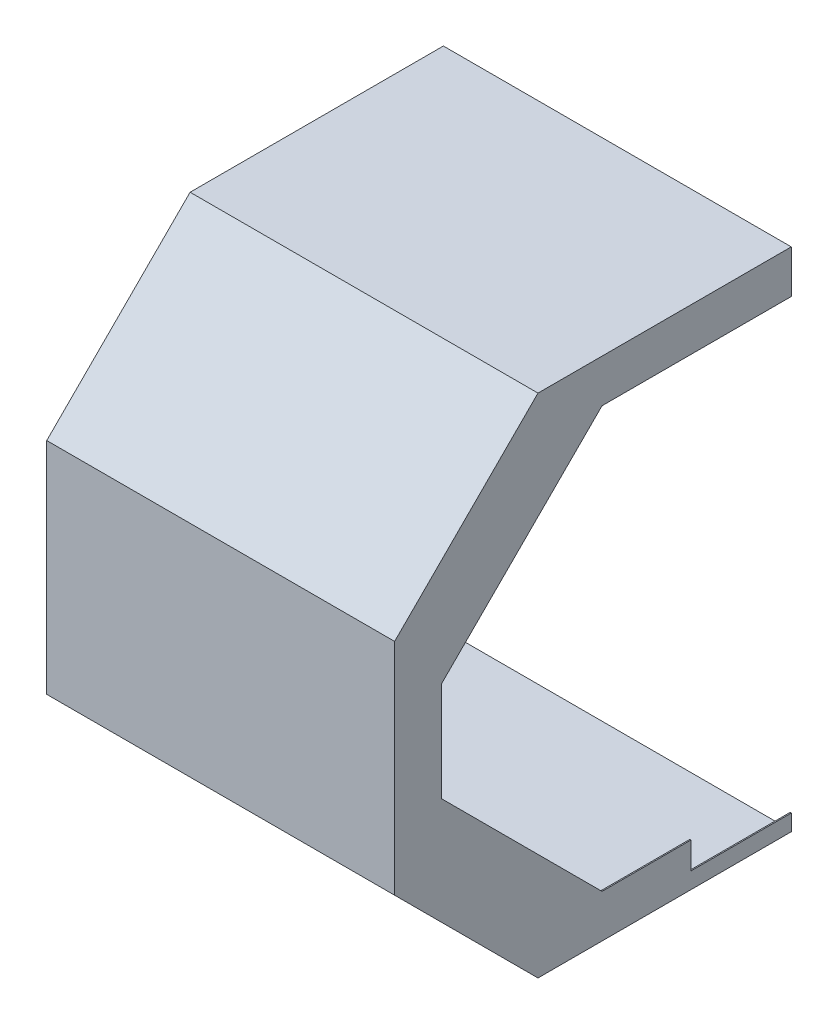
ISO-10303-21;
HEADER;
FILE_DESCRIPTION(('STEP AP214'),'2;1');
FILE_NAME('part.step','',(''),(''),'','','');
FILE_SCHEMA(('AUTOMOTIVE_DESIGN { 1 0 10303 214 1 1 1 1 }'));
ENDSEC;
DATA;
#1=APPLICATION_CONTEXT('core data for automotive mechanical design processes');
#2=APPLICATION_PROTOCOL_DEFINITION('international standard','automotive_design',2000,#1);
#3=PRODUCT_CONTEXT('',#1,'mechanical');
#4=PRODUCT('Part','Part','',(#3));
#5=PRODUCT_RELATED_PRODUCT_CATEGORY('part','',(#4));
#6=PRODUCT_DEFINITION_FORMATION('','',#4);
#7=PRODUCT_DEFINITION_CONTEXT('part definition',#1,'design');
#8=PRODUCT_DEFINITION('design','',#6,#7);
#9=PRODUCT_DEFINITION_SHAPE('','',#8);
#10=(LENGTH_UNIT() NAMED_UNIT(*) SI_UNIT(.MILLI.,.METRE.));
#11=(NAMED_UNIT(*) PLANE_ANGLE_UNIT() SI_UNIT($,.RADIAN.));
#12=(NAMED_UNIT(*) SI_UNIT($,.STERADIAN.) SOLID_ANGLE_UNIT());
#13=UNCERTAINTY_MEASURE_WITH_UNIT(LENGTH_MEASURE(1.E-05),#10,'distance_accuracy_value','');
#14=(GEOMETRIC_REPRESENTATION_CONTEXT(3) GLOBAL_UNCERTAINTY_ASSIGNED_CONTEXT((#13)) GLOBAL_UNIT_ASSIGNED_CONTEXT((#10,
#11,#12)) REPRESENTATION_CONTEXT('',''));
#15=CARTESIAN_POINT('',(0.,0.,0.));
#16=DIRECTION('',(0.,0.,1.));
#17=DIRECTION('',(1.,0.,0.));
#18=AXIS2_PLACEMENT_3D('',#15,#16,#17);
#19=CARTESIAN_POINT('',(-362.8,0.,0.));
#20=DIRECTION('',(-1.,0.,0.));
#21=DIRECTION('',(0.,-1.,0.));
#22=AXIS2_PLACEMENT_3D('',#19,#20,#21);
#23=PLANE('',#22);
#24=DIRECTION('',(0.,0.,1.));
#25=VECTOR('',#24,1.);
#26=CARTESIAN_POINT('',(-362.8,-263.8,-145.));
#27=LINE('',#26,#25);
#28=CARTESIAN_POINT('',(-362.8,-263.8,-145.));
#29=VERTEX_POINT('',#28);
#30=CARTESIAN_POINT('',(-362.8,-263.8,119.502943725152));
#31=VERTEX_POINT('',#30);
#32=EDGE_CURVE('E351',#29,#31,#27,.T.);
#33=ORIENTED_EDGE('',*,*,#32,.F.);
#34=DIRECTION('',(0.,-1.,0.));
#35=VECTOR('',#34,1.);
#36=CARTESIAN_POINT('',(-362.8,265.,-145.));
#37=LINE('',#36,#35);
#38=CARTESIAN_POINT('',(-362.8,263.8,-145.));
#39=VERTEX_POINT('',#38);
#40=EDGE_CURVE('E337',#39,#29,#37,.T.);
#41=ORIENTED_EDGE('',*,*,#40,.F.);
#42=DIRECTION('',(0.,0.,-1.));
#43=VECTOR('',#42,1.);
#44=CARTESIAN_POINT('',(-362.8,263.8,270.));
#45=LINE('',#44,#43);
#46=CARTESIAN_POINT('',(-362.8,263.8,119.502943725152));
#47=VERTEX_POINT('',#46);
#48=EDGE_CURVE('E334',#47,#39,#45,.T.);
#49=ORIENTED_EDGE('',*,*,#48,.F.);
#50=DIRECTION('',(0.,-0.707106781186548,0.707106781186548));
#51=VECTOR('',#50,1.);
#52=CARTESIAN_POINT('',(-362.8,191.651471862576,191.651471862576));
#53=LINE('',#52,#51);
#54=CARTESIAN_POINT('',(-362.8,114.502943725152,268.8));
#55=VERTEX_POINT('',#54);
#56=EDGE_CURVE('E342',#47,#55,#53,.T.);
#57=ORIENTED_EDGE('',*,*,#56,.T.);
#58=DIRECTION('',(0.,1.,0.));
#59=VECTOR('',#58,1.);
#60=CARTESIAN_POINT('',(-362.8,-265.,268.8));
#61=LINE('',#60,#59);
#62=CARTESIAN_POINT('',(-362.8,-114.502943725152,268.8));
#63=VERTEX_POINT('',#62);
#64=EDGE_CURVE('E354',#63,#55,#61,.T.);
#65=ORIENTED_EDGE('',*,*,#64,.F.);
#66=DIRECTION('',(0.,-0.707106781186548,-0.707106781186548));
#67=VECTOR('',#66,1.);
#68=CARTESIAN_POINT('',(-362.8,-191.651471862576,191.651471862576));
#69=LINE('',#68,#67);
#70=EDGE_CURVE('E348',#63,#31,#69,.T.);
#71=ORIENTED_EDGE('',*,*,#70,.T.);
#72=EDGE_LOOP('',(#33,#41,#49,#57,#65,#71));
#73=FACE_BOUND('',#72,.T.);
#74=DIRECTION('',(0.,0.,1.));
#75=VECTOR('',#74,1.);
#76=CARTESIAN_POINT('',(-362.8,-53.2,-139.5));
#77=LINE('',#76,#75);
#78=CARTESIAN_POINT('',(-362.8,-53.2,-139.5));
#79=VERTEX_POINT('',#78);
#80=CARTESIAN_POINT('',(-362.8,-53.2,-119.5));
#81=VERTEX_POINT('',#80);
#82=EDGE_CURVE('E33',#79,#81,#77,.T.);
#83=ORIENTED_EDGE('',*,*,#82,.T.);
#84=DIRECTION('',(0.,1.,0.));
#85=VECTOR('',#84,1.);
#86=CARTESIAN_POINT('',(-362.8,17.6289512568745,-119.5));
#87=LINE('',#86,#85);
#88=CARTESIAN_POINT('',(-362.8,16.798,-119.5));
#89=VERTEX_POINT('',#88);
#90=EDGE_CURVE('E224',#81,#89,#87,.T.);
#91=ORIENTED_EDGE('',*,*,#90,.T.);
#92=DIRECTION('',(0.,0.,-1.));
#93=VECTOR('',#92,1.);
#94=CARTESIAN_POINT('',(-362.8,16.798,-119.5));
#95=LINE('',#94,#93);
#96=CARTESIAN_POINT('',(-362.8,16.798,-139.5));
#97=VERTEX_POINT('',#96);
#98=EDGE_CURVE('E241',#89,#97,#95,.T.);
#99=ORIENTED_EDGE('',*,*,#98,.T.);
#100=DIRECTION('',(0.,-1.,0.));
#101=VECTOR('',#100,1.);
#102=CARTESIAN_POINT('',(-362.8,17.6289512568745,-139.5));
#103=LINE('',#102,#101);
#104=EDGE_CURVE('E38',#97,#79,#103,.T.);
#105=ORIENTED_EDGE('',*,*,#104,.T.);
#106=EDGE_LOOP('',(#83,#91,#99,#105));
#107=FACE_BOUND('',#106,.T.);
#108=ADVANCED_FACE('F18',(#73,#107),#23,.F.);
#109=CARTESIAN_POINT('',(0.,0.,0.));
#110=DIRECTION('',(-1.,0.,0.));
#111=DIRECTION('',(0.,-1.,0.));
#112=AXIS2_PLACEMENT_3D('',#109,#110,#111);
#113=PLANE('',#112);
#114=DIRECTION('',(0.,0.,1.));
#115=VECTOR('',#114,1.);
#116=CARTESIAN_POINT('',(0.,-248.,-145.));
#117=LINE('',#116,#115);
#118=CARTESIAN_POINT('',(0.,-248.,-145.));
#119=VERTEX_POINT('',#118);
#120=CARTESIAN_POINT('',(0.,-248.,-40.));
#121=VERTEX_POINT('',#120);
#122=EDGE_CURVE('E283',#119,#121,#117,.T.);
#123=ORIENTED_EDGE('',*,*,#122,.T.);
#124=DIRECTION('',(0.,1.,0.));
#125=VECTOR('',#124,1.);
#126=CARTESIAN_POINT('',(0.,-248.,-40.));
#127=LINE('',#126,#125);
#128=CARTESIAN_POINT('',(0.,-220.,-40.));
#129=VERTEX_POINT('',#128);
#130=EDGE_CURVE('E287',#121,#129,#127,.T.);
#131=ORIENTED_EDGE('',*,*,#130,.T.);
#132=DIRECTION('',(0.,0.,1.));
#133=VECTOR('',#132,1.);
#134=CARTESIAN_POINT('',(0.,-220.,-145.));
#135=LINE('',#134,#133);
#136=CARTESIAN_POINT('',(0.,-220.,53.));
#137=VERTEX_POINT('',#136);
#138=EDGE_CURVE('E303',#129,#137,#135,.T.);
#139=ORIENTED_EDGE('',*,*,#138,.T.);
#140=DIRECTION('',(0.,0.707106781186547,0.707106781186548));
#141=VECTOR('',#140,1.);
#142=CARTESIAN_POINT('',(0.,-220.,53.));
#143=LINE('',#142,#141);
#144=CARTESIAN_POINT('',(0.,-52.,221.));
#145=VERTEX_POINT('',#144);
#146=EDGE_CURVE('E306',#137,#145,#143,.T.);
#147=ORIENTED_EDGE('',*,*,#146,.T.);
#148=DIRECTION('',(0.,1.,0.));
#149=VECTOR('',#148,1.);
#150=CARTESIAN_POINT('',(0.,-52.,221.));
#151=LINE('',#150,#149);
#152=CARTESIAN_POINT('',(0.,52.,221.));
#153=VERTEX_POINT('',#152);
#154=EDGE_CURVE('E310',#145,#153,#151,.T.);
#155=ORIENTED_EDGE('',*,*,#154,.T.);
#156=DIRECTION('',(0.,0.707106781186548,-0.707106781186547));
#157=VECTOR('',#156,1.);
#158=CARTESIAN_POINT('',(0.,52.,221.));
#159=LINE('',#158,#157);
#160=CARTESIAN_POINT('',(0.,220.,53.));
#161=VERTEX_POINT('',#160);
#162=EDGE_CURVE('E314',#153,#161,#159,.T.);
#163=ORIENTED_EDGE('',*,*,#162,.T.);
#164=DIRECTION('',(0.,0.,-1.));
#165=VECTOR('',#164,1.);
#166=CARTESIAN_POINT('',(0.,220.,53.));
#167=LINE('',#166,#165);
#168=CARTESIAN_POINT('',(0.,220.,-145.));
#169=VERTEX_POINT('',#168);
#170=EDGE_CURVE('E318',#161,#169,#167,.T.);
#171=ORIENTED_EDGE('',*,*,#170,.T.);
#172=DIRECTION('',(0.,-1.,0.));
#173=VECTOR('',#172,1.);
#174=CARTESIAN_POINT('',(0.,265.,-145.));
#175=LINE('',#174,#173);
#176=CARTESIAN_POINT('',(0.,265.,-145.));
#177=VERTEX_POINT('',#176);
#178=EDGE_CURVE('E419',#177,#169,#175,.T.);
#179=ORIENTED_EDGE('',*,*,#178,.F.);
#180=DIRECTION('',(0.,0.,-1.));
#181=VECTOR('',#180,1.);
#182=CARTESIAN_POINT('',(0.,265.,270.));
#183=LINE('',#182,#181);
#184=CARTESIAN_POINT('',(0.,265.,120.));
#185=VERTEX_POINT('',#184);
#186=EDGE_CURVE('E406',#185,#177,#183,.T.);
#187=ORIENTED_EDGE('',*,*,#186,.F.);
#188=DIRECTION('',(0.,0.707106781186548,-0.707106781186548));
#189=VECTOR('',#188,1.);
#190=CARTESIAN_POINT('',(0.,115.,270.));
#191=LINE('',#190,#189);
#192=CARTESIAN_POINT('',(0.,115.,270.));
#193=VERTEX_POINT('',#192);
#194=EDGE_CURVE('E380',#193,#185,#191,.T.);
#195=ORIENTED_EDGE('',*,*,#194,.F.);
#196=DIRECTION('',(0.,1.,0.));
#197=VECTOR('',#196,1.);
#198=CARTESIAN_POINT('',(0.,-265.,270.));
#199=LINE('',#198,#197);
#200=CARTESIAN_POINT('',(0.,-115.,270.));
#201=VERTEX_POINT('',#200);
#202=EDGE_CURVE('E418',#201,#193,#199,.T.);
#203=ORIENTED_EDGE('',*,*,#202,.F.);
#204=DIRECTION('',(0.,0.707106781186548,0.707106781186548));
#205=VECTOR('',#204,1.);
#206=CARTESIAN_POINT('',(0.,-265.,120.));
#207=LINE('',#206,#205);
#208=CARTESIAN_POINT('',(0.,-265.,120.));
#209=VERTEX_POINT('',#208);
#210=EDGE_CURVE('E396',#209,#201,#207,.T.);
#211=ORIENTED_EDGE('',*,*,#210,.F.);
#212=DIRECTION('',(0.,0.,1.));
#213=VECTOR('',#212,1.);
#214=CARTESIAN_POINT('',(0.,-265.,-145.));
#215=LINE('',#214,#213);
#216=CARTESIAN_POINT('',(0.,-265.,-145.));
#217=VERTEX_POINT('',#216);
#218=EDGE_CURVE('E423',#217,#209,#215,.T.);
#219=ORIENTED_EDGE('',*,*,#218,.F.);
#220=EDGE_CURVE('E424',#119,#217,#175,.T.);
#221=ORIENTED_EDGE('',*,*,#220,.F.);
#222=EDGE_LOOP('',(#123,#131,#139,#147,#155,#163,#171,#179,#187,#195,#203,#211,#219,#221));
#223=FACE_BOUND('',#222,.T.);
#224=ADVANCED_FACE('F462',(#223),#113,.F.);
#225=CARTESIAN_POINT('',(-1.2,0.,0.));
#226=DIRECTION('',(-1.,0.,0.));
#227=DIRECTION('',(0.,-1.,0.));
#228=AXIS2_PLACEMENT_3D('',#225,#226,#227);
#229=PLANE('',#228);
#230=DIRECTION('',(0.,-1.,0.));
#231=VECTOR('',#230,1.);
#232=CARTESIAN_POINT('',(-1.2,0.,-40.));
#233=LINE('',#232,#231);
#234=CARTESIAN_POINT('',(-1.19999999999998,-220.,-40.));
#235=VERTEX_POINT('',#234);
#236=CARTESIAN_POINT('',(-1.19999999999998,-248.,-40.));
#237=VERTEX_POINT('',#236);
#238=EDGE_CURVE('E297',#235,#237,#233,.T.);
#239=ORIENTED_EDGE('',*,*,#238,.T.);
#240=DIRECTION('',(0.,0.,-1.));
#241=VECTOR('',#240,1.);
#242=CARTESIAN_POINT('',(-1.20000000000001,-248.,0.));
#243=LINE('',#242,#241);
#244=CARTESIAN_POINT('',(-1.19999999999998,-248.,-145.));
#245=VERTEX_POINT('',#244);
#246=EDGE_CURVE('E300',#237,#245,#243,.T.);
#247=ORIENTED_EDGE('',*,*,#246,.T.);
#248=DIRECTION('',(0.,-1.,0.));
#249=VECTOR('',#248,1.);
#250=CARTESIAN_POINT('',(-1.19999999999998,265.,-145.));
#251=LINE('',#250,#249);
#252=CARTESIAN_POINT('',(-1.20000000000002,-263.8,-145.));
#253=VERTEX_POINT('',#252);
#254=EDGE_CURVE('E347',#245,#253,#251,.T.);
#255=ORIENTED_EDGE('',*,*,#254,.T.);
#256=DIRECTION('',(0.,0.,1.));
#257=VECTOR('',#256,1.);
#258=CARTESIAN_POINT('',(-1.19999999999998,-263.8,-145.));
#259=LINE('',#258,#257);
#260=CARTESIAN_POINT('',(-1.20000000000002,-263.8,119.502943725152));
#261=VERTEX_POINT('',#260);
#262=EDGE_CURVE('E360',#253,#261,#259,.T.);
#263=ORIENTED_EDGE('',*,*,#262,.T.);
#264=DIRECTION('',(0.,0.707106781186548,0.707106781186548));
#265=VECTOR('',#264,1.);
#266=CARTESIAN_POINT('',(-1.19999999999998,-264.151471862576,119.151471862576));
#267=LINE('',#266,#265);
#268=CARTESIAN_POINT('',(-1.2,-114.502943725152,268.8));
#269=VERTEX_POINT('',#268);
#270=EDGE_CURVE('E350',#261,#269,#267,.T.);
#271=ORIENTED_EDGE('',*,*,#270,.T.);
#272=DIRECTION('',(0.,1.,0.));
#273=VECTOR('',#272,1.);
#274=CARTESIAN_POINT('',(-1.19999999999998,-265.,268.8));
#275=LINE('',#274,#273);
#276=CARTESIAN_POINT('',(-1.2,114.502943725152,268.8));
#277=VERTEX_POINT('',#276);
#278=EDGE_CURVE('E338',#269,#277,#275,.T.);
#279=ORIENTED_EDGE('',*,*,#278,.T.);
#280=DIRECTION('',(0.,0.707106781186548,-0.707106781186548));
#281=VECTOR('',#280,1.);
#282=CARTESIAN_POINT('',(-1.19999999999998,114.151471862576,269.151471862576));
#283=LINE('',#282,#281);
#284=CARTESIAN_POINT('',(-1.19999999999998,263.8,119.502943725152));
#285=VERTEX_POINT('',#284);
#286=EDGE_CURVE('E333',#277,#285,#283,.T.);
#287=ORIENTED_EDGE('',*,*,#286,.T.);
#288=DIRECTION('',(0.,0.,-1.));
#289=VECTOR('',#288,1.);
#290=CARTESIAN_POINT('',(-1.19999999999998,263.8,270.));
#291=LINE('',#290,#289);
#292=CARTESIAN_POINT('',(-1.19999999999998,263.8,-145.));
#293=VERTEX_POINT('',#292);
#294=EDGE_CURVE('E344',#285,#293,#291,.T.);
#295=ORIENTED_EDGE('',*,*,#294,.T.);
#296=CARTESIAN_POINT('',(-1.19999999999998,220.,-145.));
#297=VERTEX_POINT('',#296);
#298=EDGE_CURVE('E364',#293,#297,#251,.T.);
#299=ORIENTED_EDGE('',*,*,#298,.T.);
#300=DIRECTION('',(0.,0.,1.));
#301=VECTOR('',#300,1.);
#302=CARTESIAN_POINT('',(-1.19999999999999,220.,0.));
#303=LINE('',#302,#301);
#304=CARTESIAN_POINT('',(-1.19999999999998,220.,53.));
#305=VERTEX_POINT('',#304);
#306=EDGE_CURVE('E438',#297,#305,#303,.T.);
#307=ORIENTED_EDGE('',*,*,#306,.T.);
#308=DIRECTION('',(0.,-0.707106781186548,0.707106781186547));
#309=VECTOR('',#308,1.);
#310=CARTESIAN_POINT('',(-1.2,136.5,136.5));
#311=LINE('',#310,#309);
#312=CARTESIAN_POINT('',(-1.19999999999998,52.,221.));
#313=VERTEX_POINT('',#312);
#314=EDGE_CURVE('E441',#305,#313,#311,.T.);
#315=ORIENTED_EDGE('',*,*,#314,.T.);
#316=DIRECTION('',(0.,-1.,0.));
#317=VECTOR('',#316,1.);
#318=CARTESIAN_POINT('',(-1.2,0.,221.));
#319=LINE('',#318,#317);
#320=CARTESIAN_POINT('',(-1.19999999999998,-52.,221.));
#321=VERTEX_POINT('',#320);
#322=EDGE_CURVE('E444',#313,#321,#319,.T.);
#323=ORIENTED_EDGE('',*,*,#322,.T.);
#324=DIRECTION('',(0.,-0.707106781186548,-0.707106781186548));
#325=VECTOR('',#324,1.);
#326=CARTESIAN_POINT('',(-1.2,-136.5,136.5));
#327=LINE('',#326,#325);
#328=CARTESIAN_POINT('',(-1.19999999999998,-220.,53.));
#329=VERTEX_POINT('',#328);
#330=EDGE_CURVE('E447',#321,#329,#327,.T.);
#331=ORIENTED_EDGE('',*,*,#330,.T.);
#332=DIRECTION('',(0.,0.,-1.));
#333=VECTOR('',#332,1.);
#334=CARTESIAN_POINT('',(-1.20000000000001,-220.,0.));
#335=LINE('',#334,#333);
#336=EDGE_CURVE('E26',#329,#235,#335,.T.);
#337=ORIENTED_EDGE('',*,*,#336,.T.);
#338=EDGE_LOOP('',(#239,#247,#255,#263,#271,#279,#287,#295,#299,#307,#315,#323,#331,#337));
#339=FACE_BOUND('',#338,.T.);
#340=ADVANCED_FACE('F451',(#339),#229,.T.);
#341=CARTESIAN_POINT('',(-765.258779760154,-220.,-145.));
#342=DIRECTION('',(0.,1.,0.));
#343=DIRECTION('',(0.,0.,1.));
#344=AXIS2_PLACEMENT_3D('',#341,#342,#343);
#345=PLANE('',#344);
#346=ORIENTED_EDGE('',*,*,#138,.F.);
#347=DIRECTION('',(-1.,0.,0.));
#348=VECTOR('',#347,1.);
#349=CARTESIAN_POINT('',(-765.258779760154,-220.,-40.));
#350=LINE('',#349,#348);
#351=EDGE_CURVE('E11',#129,#235,#350,.T.);
#352=ORIENTED_EDGE('',*,*,#351,.T.);
#353=ORIENTED_EDGE('',*,*,#336,.F.);
#354=DIRECTION('',(1.,0.,0.));
#355=VECTOR('',#354,1.);
#356=CARTESIAN_POINT('',(-765.258779760154,-220.,53.));
#357=LINE('',#356,#355);
#358=EDGE_CURVE('E330',#329,#137,#357,.T.);
#359=ORIENTED_EDGE('',*,*,#358,.T.);
#360=EDGE_LOOP('',(#346,#352,#353,#359));
#361=FACE_BOUND('',#360,.T.);
#362=ADVANCED_FACE('F455',(#361),#345,.T.);
#363=CARTESIAN_POINT('',(-364.,265.,-145.));
#364=DIRECTION('',(0.,0.,1.));
#365=DIRECTION('',(0.,-1.,0.));
#366=AXIS2_PLACEMENT_3D('',#363,#364,#365);
#367=PLANE('',#366);
#368=DIRECTION('',(1.,0.,0.));
#369=VECTOR('',#368,1.);
#370=CARTESIAN_POINT('',(-364.,-265.,-145.));
#371=LINE('',#370,#369);
#372=CARTESIAN_POINT('',(-364.,-265.,-145.));
#373=VERTEX_POINT('',#372);
#374=EDGE_CURVE('E416',#373,#217,#371,.T.);
#375=ORIENTED_EDGE('',*,*,#374,.F.);
#376=DIRECTION('',(0.,-1.,0.));
#377=VECTOR('',#376,1.);
#378=CARTESIAN_POINT('',(-364.,265.,-145.));
#379=LINE('',#378,#377);
#380=CARTESIAN_POINT('',(-364.,265.,-145.));
#381=VERTEX_POINT('',#380);
#382=EDGE_CURVE('E407',#381,#373,#379,.T.);
#383=ORIENTED_EDGE('',*,*,#382,.F.);
#384=DIRECTION('',(1.,0.,0.));
#385=VECTOR('',#384,1.);
#386=CARTESIAN_POINT('',(-364.,265.,-145.));
#387=LINE('',#386,#385);
#388=EDGE_CURVE('E435',#381,#177,#387,.T.);
#389=ORIENTED_EDGE('',*,*,#388,.T.);
#390=ORIENTED_EDGE('',*,*,#178,.T.);
#391=DIRECTION('',(1.,0.,0.));
#392=VECTOR('',#391,1.);
#393=CARTESIAN_POINT('',(-765.258779760154,220.,-145.));
#394=LINE('',#393,#392);
#395=EDGE_CURVE('E322',#297,#169,#394,.T.);
#396=ORIENTED_EDGE('',*,*,#395,.F.);
#397=ORIENTED_EDGE('',*,*,#298,.F.);
#398=DIRECTION('',(1.,0.,0.));
#399=VECTOR('',#398,1.);
#400=CARTESIAN_POINT('',(-364.,263.8,-145.));
#401=LINE('',#400,#399);
#402=EDGE_CURVE('E377',#39,#293,#401,.T.);
#403=ORIENTED_EDGE('',*,*,#402,.F.);
#404=ORIENTED_EDGE('',*,*,#40,.T.);
#405=DIRECTION('',(1.,0.,0.));
#406=VECTOR('',#405,1.);
#407=CARTESIAN_POINT('',(-364.,-263.8,-145.));
#408=LINE('',#407,#406);
#409=EDGE_CURVE('E359',#29,#253,#408,.T.);
#410=ORIENTED_EDGE('',*,*,#409,.T.);
#411=ORIENTED_EDGE('',*,*,#254,.F.);
#412=DIRECTION('',(1.,0.,0.));
#413=VECTOR('',#412,1.);
#414=CARTESIAN_POINT('',(-765.258779760154,-248.,-145.));
#415=LINE('',#414,#413);
#416=EDGE_CURVE('E294',#245,#119,#415,.T.);
#417=ORIENTED_EDGE('',*,*,#416,.T.);
#418=ORIENTED_EDGE('',*,*,#220,.T.);
#419=EDGE_LOOP('',(#375,#383,#389,#390,#396,#397,#403,#404,#410,#411,#417,#418));
#420=FACE_BOUND('',#419,.T.);
#421=ADVANCED_FACE('F473',(#420),#367,.F.);
#422=CARTESIAN_POINT('',(-364.,265.,270.));
#423=DIRECTION('',(0.,-1.,0.));
#424=DIRECTION('',(0.,0.,-1.));
#425=AXIS2_PLACEMENT_3D('',#422,#423,#424);
#426=PLANE('',#425);
#427=DIRECTION('',(0.,0.,-1.));
#428=VECTOR('',#427,1.);
#429=CARTESIAN_POINT('',(-364.,265.,270.));
#430=LINE('',#429,#428);
#431=CARTESIAN_POINT('',(-364.,265.,120.));
#432=VERTEX_POINT('',#431);
#433=EDGE_CURVE('E410',#432,#381,#430,.T.);
#434=ORIENTED_EDGE('',*,*,#433,.F.);
#435=DIRECTION('',(1.,0.,0.));
#436=VECTOR('',#435,1.);
#437=CARTESIAN_POINT('',(-765.258779760154,265.,120.));
#438=LINE('',#437,#436);
#439=EDGE_CURVE('E391',#432,#185,#438,.T.);
#440=ORIENTED_EDGE('',*,*,#439,.T.);
#441=ORIENTED_EDGE('',*,*,#186,.T.);
#442=ORIENTED_EDGE('',*,*,#388,.F.);
#443=EDGE_LOOP('',(#434,#440,#441,#442));
#444=FACE_BOUND('',#443,.T.);
#445=ADVANCED_FACE('F20',(#444),#426,.F.);
#446=CARTESIAN_POINT('',(-364.,-265.,-145.));
#447=DIRECTION('',(0.,1.,0.));
#448=DIRECTION('',(0.,0.,1.));
#449=AXIS2_PLACEMENT_3D('',#446,#447,#448);
#450=PLANE('',#449);
#451=ORIENTED_EDGE('',*,*,#218,.T.);
#452=DIRECTION('',(1.,0.,0.));
#453=VECTOR('',#452,1.);
#454=CARTESIAN_POINT('',(-765.258779760154,-265.,120.));
#455=LINE('',#454,#453);
#456=CARTESIAN_POINT('',(-364.,-265.,120.));
#457=VERTEX_POINT('',#456);
#458=EDGE_CURVE('E402',#457,#209,#455,.T.);
#459=ORIENTED_EDGE('',*,*,#458,.F.);
#460=DIRECTION('',(0.,0.,1.));
#461=VECTOR('',#460,1.);
#462=CARTESIAN_POINT('',(-364.,-265.,-145.));
#463=LINE('',#462,#461);
#464=EDGE_CURVE('E409',#373,#457,#463,.T.);
#465=ORIENTED_EDGE('',*,*,#464,.F.);
#466=ORIENTED_EDGE('',*,*,#374,.T.);
#467=EDGE_LOOP('',(#451,#459,#465,#466));
#468=FACE_BOUND('',#467,.T.);
#469=ADVANCED_FACE('F607',(#468),#450,.F.);
#470=CARTESIAN_POINT('',(-364.,-265.,270.));
#471=DIRECTION('',(0.,0.,-1.));
#472=DIRECTION('',(0.,1.,0.));
#473=AXIS2_PLACEMENT_3D('',#470,#471,#472);
#474=PLANE('',#473);
#475=ORIENTED_EDGE('',*,*,#202,.T.);
#476=DIRECTION('',(1.,0.,0.));
#477=VECTOR('',#476,1.);
#478=CARTESIAN_POINT('',(-765.258779760154,115.,270.));
#479=LINE('',#478,#477);
#480=CARTESIAN_POINT('',(-364.,115.,270.));
#481=VERTEX_POINT('',#480);
#482=EDGE_CURVE('E389',#481,#193,#479,.T.);
#483=ORIENTED_EDGE('',*,*,#482,.F.);
#484=DIRECTION('',(0.,1.,0.));
#485=VECTOR('',#484,1.);
#486=CARTESIAN_POINT('',(-364.,-265.,270.));
#487=LINE('',#486,#485);
#488=CARTESIAN_POINT('',(-364.,-115.,270.));
#489=VERTEX_POINT('',#488);
#490=EDGE_CURVE('E413',#489,#481,#487,.T.);
#491=ORIENTED_EDGE('',*,*,#490,.F.);
#492=DIRECTION('',(1.,0.,0.));
#493=VECTOR('',#492,1.);
#494=CARTESIAN_POINT('',(-765.258779760154,-115.,270.));
#495=LINE('',#494,#493);
#496=EDGE_CURVE('E399',#489,#201,#495,.T.);
#497=ORIENTED_EDGE('',*,*,#496,.T.);
#498=EDGE_LOOP('',(#475,#483,#491,#497));
#499=FACE_BOUND('',#498,.T.);
#500=ADVANCED_FACE('F602',(#499),#474,.F.);
#501=CARTESIAN_POINT('',(-364.,0.,0.));
#502=DIRECTION('',(-1.,0.,0.));
#503=DIRECTION('',(0.,-1.,0.));
#504=AXIS2_PLACEMENT_3D('',#501,#502,#503);
#505=PLANE('',#504);
#506=ORIENTED_EDGE('',*,*,#382,.T.);
#507=ORIENTED_EDGE('',*,*,#464,.T.);
#508=DIRECTION('',(0.,-0.707106781186548,-0.707106781186548));
#509=VECTOR('',#508,1.);
#510=CARTESIAN_POINT('',(-364.,-192.5,192.5));
#511=LINE('',#510,#509);
#512=EDGE_CURVE('E404',#489,#457,#511,.T.);
#513=ORIENTED_EDGE('',*,*,#512,.F.);
#514=ORIENTED_EDGE('',*,*,#490,.T.);
#515=DIRECTION('',(0.,-0.707106781186548,0.707106781186548));
#516=VECTOR('',#515,1.);
#517=CARTESIAN_POINT('',(-364.,192.5,192.5));
#518=LINE('',#517,#516);
#519=EDGE_CURVE('E394',#432,#481,#518,.T.);
#520=ORIENTED_EDGE('',*,*,#519,.F.);
#521=ORIENTED_EDGE('',*,*,#433,.T.);
#522=EDGE_LOOP('',(#506,#507,#513,#514,#520,#521));
#523=FACE_BOUND('',#522,.T.);
#524=ADVANCED_FACE('F599',(#523),#505,.T.);
#525=CARTESIAN_POINT('',(-765.258779760154,-265.,120.));
#526=DIRECTION('',(0.,0.707106781186548,-0.707106781186548));
#527=DIRECTION('',(0.,0.707106781186548,0.707106781186548));
#528=AXIS2_PLACEMENT_3D('',#525,#526,#527);
#529=PLANE('',#528);
#530=ORIENTED_EDGE('',*,*,#512,.T.);
#531=ORIENTED_EDGE('',*,*,#458,.T.);
#532=ORIENTED_EDGE('',*,*,#210,.T.);
#533=ORIENTED_EDGE('',*,*,#496,.F.);
#534=EDGE_LOOP('',(#530,#531,#532,#533));
#535=FACE_BOUND('',#534,.T.);
#536=ADVANCED_FACE('F595',(#535),#529,.F.);
#537=CARTESIAN_POINT('',(-765.258779760154,115.,270.));
#538=DIRECTION('',(0.,-0.707106781186548,-0.707106781186548));
#539=DIRECTION('',(0.,0.707106781186548,-0.707106781186548));
#540=AXIS2_PLACEMENT_3D('',#537,#538,#539);
#541=PLANE('',#540);
#542=ORIENTED_EDGE('',*,*,#519,.T.);
#543=ORIENTED_EDGE('',*,*,#482,.T.);
#544=ORIENTED_EDGE('',*,*,#194,.T.);
#545=ORIENTED_EDGE('',*,*,#439,.F.);
#546=EDGE_LOOP('',(#542,#543,#544,#545));
#547=FACE_BOUND('',#546,.T.);
#548=ADVANCED_FACE('F591',(#547),#541,.F.);
#549=CARTESIAN_POINT('',(-364.,263.8,270.));
#550=DIRECTION('',(0.,-1.,0.));
#551=DIRECTION('',(0.,0.,-1.));
#552=AXIS2_PLACEMENT_3D('',#549,#550,#551);
#553=PLANE('',#552);
#554=ORIENTED_EDGE('',*,*,#48,.T.);
#555=ORIENTED_EDGE('',*,*,#402,.T.);
#556=ORIENTED_EDGE('',*,*,#294,.F.);
#557=DIRECTION('',(1.,0.,0.));
#558=VECTOR('',#557,1.);
#559=CARTESIAN_POINT('',(-364.,263.8,119.502943725152));
#560=LINE('',#559,#558);
#561=EDGE_CURVE('E339',#47,#285,#560,.T.);
#562=ORIENTED_EDGE('',*,*,#561,.F.);
#563=EDGE_LOOP('',(#554,#555,#556,#562));
#564=FACE_BOUND('',#563,.T.);
#565=ADVANCED_FACE('F594',(#564),#553,.T.);
#566=CARTESIAN_POINT('',(-364.,-263.8,-145.));
#567=DIRECTION('',(0.,1.,0.));
#568=DIRECTION('',(0.,0.,1.));
#569=AXIS2_PLACEMENT_3D('',#566,#567,#568);
#570=PLANE('',#569);
#571=ORIENTED_EDGE('',*,*,#262,.F.);
#572=ORIENTED_EDGE('',*,*,#409,.F.);
#573=ORIENTED_EDGE('',*,*,#32,.T.);
#574=DIRECTION('',(1.,0.,0.));
#575=VECTOR('',#574,1.);
#576=CARTESIAN_POINT('',(-765.258779760154,-263.8,119.502943725152));
#577=LINE('',#576,#575);
#578=EDGE_CURVE('E356',#31,#261,#577,.T.);
#579=ORIENTED_EDGE('',*,*,#578,.T.);
#580=EDGE_LOOP('',(#571,#572,#573,#579));
#581=FACE_BOUND('',#580,.T.);
#582=ADVANCED_FACE('F624',(#581),#570,.T.);
#583=CARTESIAN_POINT('',(-364.,-265.,268.8));
#584=DIRECTION('',(0.,0.,-1.));
#585=DIRECTION('',(0.,1.,0.));
#586=AXIS2_PLACEMENT_3D('',#583,#584,#585);
#587=PLANE('',#586);
#588=ORIENTED_EDGE('',*,*,#278,.F.);
#589=DIRECTION('',(1.,0.,0.));
#590=VECTOR('',#589,1.);
#591=CARTESIAN_POINT('',(-364.,-114.502943725152,268.8));
#592=LINE('',#591,#590);
#593=EDGE_CURVE('E366',#63,#269,#592,.T.);
#594=ORIENTED_EDGE('',*,*,#593,.F.);
#595=ORIENTED_EDGE('',*,*,#64,.T.);
#596=DIRECTION('',(1.,0.,0.));
#597=VECTOR('',#596,1.);
#598=CARTESIAN_POINT('',(-765.258779760154,114.502943725152,268.8));
#599=LINE('',#598,#597);
#600=EDGE_CURVE('E343',#55,#277,#599,.T.);
#601=ORIENTED_EDGE('',*,*,#600,.T.);
#602=EDGE_LOOP('',(#588,#594,#595,#601));
#603=FACE_BOUND('',#602,.T.);
#604=ADVANCED_FACE('F579',(#603),#587,.T.);
#605=CARTESIAN_POINT('',(-765.258779760154,-264.151471862576,119.151471862576));
#606=DIRECTION('',(0.,0.707106781186548,-0.707106781186548));
#607=DIRECTION('',(0.,0.707106781186548,0.707106781186548));
#608=AXIS2_PLACEMENT_3D('',#605,#606,#607);
#609=PLANE('',#608);
#610=ORIENTED_EDGE('',*,*,#70,.F.);
#611=ORIENTED_EDGE('',*,*,#593,.T.);
#612=ORIENTED_EDGE('',*,*,#270,.F.);
#613=ORIENTED_EDGE('',*,*,#578,.F.);
#614=EDGE_LOOP('',(#610,#611,#612,#613));
#615=FACE_BOUND('',#614,.T.);
#616=ADVANCED_FACE('F583',(#615),#609,.T.);
#617=CARTESIAN_POINT('',(-765.258779760154,114.151471862576,269.151471862576));
#618=DIRECTION('',(0.,-0.707106781186548,-0.707106781186548));
#619=DIRECTION('',(0.,0.707106781186548,-0.707106781186548));
#620=AXIS2_PLACEMENT_3D('',#617,#618,#619);
#621=PLANE('',#620);
#622=ORIENTED_EDGE('',*,*,#56,.F.);
#623=ORIENTED_EDGE('',*,*,#561,.T.);
#624=ORIENTED_EDGE('',*,*,#286,.F.);
#625=ORIENTED_EDGE('',*,*,#600,.F.);
#626=EDGE_LOOP('',(#622,#623,#624,#625));
#627=FACE_BOUND('',#626,.T.);
#628=ADVANCED_FACE('F586',(#627),#621,.T.);
#629=CARTESIAN_POINT('',(-765.258779760154,-220.,53.));
#630=DIRECTION('',(0.,0.707106781186548,-0.707106781186547));
#631=DIRECTION('',(0.,0.707106781186548,0.707106781186548));
#632=AXIS2_PLACEMENT_3D('',#629,#630,#631);
#633=PLANE('',#632);
#634=DIRECTION('',(1.,0.,0.));
#635=VECTOR('',#634,1.);
#636=CARTESIAN_POINT('',(-765.258779760154,-52.,221.));
#637=LINE('',#636,#635);
#638=EDGE_CURVE('E328',#321,#145,#637,.T.);
#639=ORIENTED_EDGE('',*,*,#638,.T.);
#640=ORIENTED_EDGE('',*,*,#146,.F.);
#641=ORIENTED_EDGE('',*,*,#358,.F.);
#642=ORIENTED_EDGE('',*,*,#330,.F.);
#643=EDGE_LOOP('',(#639,#640,#641,#642));
#644=FACE_BOUND('',#643,.T.);
#645=ADVANCED_FACE('F458',(#644),#633,.T.);
#646=CARTESIAN_POINT('',(-765.258779760154,-52.,221.));
#647=DIRECTION('',(0.,0.,-1.));
#648=DIRECTION('',(-1.,0.,0.));
#649=AXIS2_PLACEMENT_3D('',#646,#647,#648);
#650=PLANE('',#649);
#651=DIRECTION('',(1.,0.,0.));
#652=VECTOR('',#651,1.);
#653=CARTESIAN_POINT('',(-765.258779760154,52.,221.));
#654=LINE('',#653,#652);
#655=EDGE_CURVE('E326',#313,#153,#654,.T.);
#656=ORIENTED_EDGE('',*,*,#655,.T.);
#657=ORIENTED_EDGE('',*,*,#154,.F.);
#658=ORIENTED_EDGE('',*,*,#638,.F.);
#659=ORIENTED_EDGE('',*,*,#322,.F.);
#660=EDGE_LOOP('',(#656,#657,#658,#659));
#661=FACE_BOUND('',#660,.T.);
#662=ADVANCED_FACE('F656',(#661),#650,.T.);
#663=CARTESIAN_POINT('',(-765.258779760154,52.,221.));
#664=DIRECTION('',(0.,-0.707106781186547,-0.707106781186548));
#665=DIRECTION('',(0.,0.707106781186548,-0.707106781186547));
#666=AXIS2_PLACEMENT_3D('',#663,#664,#665);
#667=PLANE('',#666);
#668=DIRECTION('',(1.,0.,0.));
#669=VECTOR('',#668,1.);
#670=CARTESIAN_POINT('',(-765.258779760154,220.,53.));
#671=LINE('',#670,#669);
#672=EDGE_CURVE('E324',#305,#161,#671,.T.);
#673=ORIENTED_EDGE('',*,*,#672,.T.);
#674=ORIENTED_EDGE('',*,*,#162,.F.);
#675=ORIENTED_EDGE('',*,*,#655,.F.);
#676=ORIENTED_EDGE('',*,*,#314,.F.);
#677=EDGE_LOOP('',(#673,#674,#675,#676));
#678=FACE_BOUND('',#677,.T.);
#679=ADVANCED_FACE('F654',(#678),#667,.T.);
#680=CARTESIAN_POINT('',(-765.258779760154,220.,53.));
#681=DIRECTION('',(0.,-1.,0.));
#682=DIRECTION('',(1.,0.,0.));
#683=AXIS2_PLACEMENT_3D('',#680,#681,#682);
#684=PLANE('',#683);
#685=ORIENTED_EDGE('',*,*,#395,.T.);
#686=ORIENTED_EDGE('',*,*,#170,.F.);
#687=ORIENTED_EDGE('',*,*,#672,.F.);
#688=ORIENTED_EDGE('',*,*,#306,.F.);
#689=EDGE_LOOP('',(#685,#686,#687,#688));
#690=FACE_BOUND('',#689,.T.);
#691=ADVANCED_FACE('F648',(#690),#684,.T.);
#692=CARTESIAN_POINT('',(-765.258779760154,-248.,-145.));
#693=DIRECTION('',(0.,1.,0.));
#694=DIRECTION('',(-1.,0.,0.));
#695=AXIS2_PLACEMENT_3D('',#692,#693,#694);
#696=PLANE('',#695);
#697=DIRECTION('',(1.,0.,0.));
#698=VECTOR('',#697,1.);
#699=CARTESIAN_POINT('',(-765.258779760154,-248.,-40.));
#700=LINE('',#699,#698);
#701=EDGE_CURVE('E291',#237,#121,#700,.T.);
#702=ORIENTED_EDGE('',*,*,#701,.T.);
#703=ORIENTED_EDGE('',*,*,#122,.F.);
#704=ORIENTED_EDGE('',*,*,#416,.F.);
#705=ORIENTED_EDGE('',*,*,#246,.F.);
#706=EDGE_LOOP('',(#702,#703,#704,#705));
#707=FACE_BOUND('',#706,.T.);
#708=ADVANCED_FACE('F468',(#707),#696,.T.);
#709=CARTESIAN_POINT('',(-765.258779760154,-248.,-40.));
#710=DIRECTION('',(0.,0.,-1.));
#711=DIRECTION('',(-1.,0.,0.));
#712=AXIS2_PLACEMENT_3D('',#709,#710,#711);
#713=PLANE('',#712);
#714=ORIENTED_EDGE('',*,*,#351,.F.);
#715=ORIENTED_EDGE('',*,*,#130,.F.);
#716=ORIENTED_EDGE('',*,*,#701,.F.);
#717=ORIENTED_EDGE('',*,*,#238,.F.);
#718=EDGE_LOOP('',(#714,#715,#716,#717));
#719=FACE_BOUND('',#718,.T.);
#720=ADVANCED_FACE('F466',(#719),#713,.T.);
#721=CARTESIAN_POINT('',(-358.2,16.8,-119.5));
#722=DIRECTION('',(0.,0.,1.));
#723=DIRECTION('',(-1.,0.,0.));
#724=AXIS2_PLACEMENT_3D('',#721,#722,#723);
#725=PLANE('',#724);
#726=DIRECTION('',(1.,0.,0.));
#727=VECTOR('',#726,1.);
#728=CARTESIAN_POINT('',(-358.2,20.,-119.5));
#729=LINE('',#728,#727);
#730=CARTESIAN_POINT('',(-359.598,20.,-119.5));
#731=VERTEX_POINT('',#730);
#732=CARTESIAN_POINT('',(-328.2,20.,-119.5));
#733=VERTEX_POINT('',#732);
#734=EDGE_CURVE('E267',#731,#733,#729,.T.);
#735=ORIENTED_EDGE('',*,*,#734,.F.);
#736=CARTESIAN_POINT('',(-359.598,16.798,-119.5));
#737=DIRECTION('',(0.,0.,-1.));
#738=DIRECTION('',(0.,-1.,0.));
#739=AXIS2_PLACEMENT_3D('',#736,#737,#738);
#740=CIRCLE('',#739,3.202);
#741=EDGE_CURVE('E234',#89,#731,#740,.T.);
#742=ORIENTED_EDGE('',*,*,#741,.F.);
#743=ORIENTED_EDGE('',*,*,#90,.F.);
#744=DIRECTION('',(1.,0.,0.));
#745=VECTOR('',#744,1.);
#746=CARTESIAN_POINT('',(-362.8,-53.2,-119.5));
#747=LINE('',#746,#745);
#748=CARTESIAN_POINT('',(-359.6,-53.2,-119.5));
#749=VERTEX_POINT('',#748);
#750=EDGE_CURVE('E250',#81,#749,#747,.T.);
#751=ORIENTED_EDGE('',*,*,#750,.T.);
#752=DIRECTION('',(0.,1.,0.));
#753=VECTOR('',#752,1.);
#754=CARTESIAN_POINT('',(-359.6,17.6289512568745,-119.5));
#755=LINE('',#754,#753);
#756=CARTESIAN_POINT('',(-359.6,16.798,-119.5));
#757=VERTEX_POINT('',#756);
#758=EDGE_CURVE('E240',#749,#757,#755,.T.);
#759=ORIENTED_EDGE('',*,*,#758,.T.);
#760=CARTESIAN_POINT('',(-359.598,16.798,-119.5));
#761=DIRECTION('',(0.,0.,1.));
#762=DIRECTION('',(0.,1.,0.));
#763=AXIS2_PLACEMENT_3D('',#760,#761,#762);
#764=CIRCLE('',#763,0.00199999999999983);
#765=CARTESIAN_POINT('',(-359.598,16.8,-119.5));
#766=VERTEX_POINT('',#765);
#767=EDGE_CURVE('E235',#757,#766,#764,.F.);
#768=ORIENTED_EDGE('',*,*,#767,.T.);
#769=DIRECTION('',(1.,0.,0.));
#770=VECTOR('',#769,1.);
#771=CARTESIAN_POINT('',(-358.2,16.8,-119.5));
#772=LINE('',#771,#770);
#773=CARTESIAN_POINT('',(-328.2,16.8,-119.5));
#774=VERTEX_POINT('',#773);
#775=EDGE_CURVE('E487',#766,#774,#772,.T.);
#776=ORIENTED_EDGE('',*,*,#775,.T.);
#777=DIRECTION('',(0.,1.,0.));
#778=VECTOR('',#777,1.);
#779=CARTESIAN_POINT('',(-328.2,16.8,-119.5));
#780=LINE('',#779,#778);
#781=EDGE_CURVE('E514',#774,#733,#780,.T.);
#782=ORIENTED_EDGE('',*,*,#781,.T.);
#783=EDGE_LOOP('',(#735,#742,#743,#751,#759,#768,#776,#782));
#784=FACE_BOUND('',#783,.T.);
#785=ADVANCED_FACE('F535',(#784),#725,.T.);
#786=CARTESIAN_POINT('',(-362.8,20.,-139.5));
#787=DIRECTION('',(0.,0.,-1.));
#788=DIRECTION('',(1.,0.,0.));
#789=AXIS2_PLACEMENT_3D('',#786,#787,#788);
#790=PLANE('',#789);
#791=DIRECTION('',(1.,0.,0.));
#792=VECTOR('',#791,1.);
#793=CARTESIAN_POINT('',(-362.8,16.8,-139.5));
#794=LINE('',#793,#792);
#795=CARTESIAN_POINT('',(-359.598,16.8,-139.5));
#796=VERTEX_POINT('',#795);
#797=CARTESIAN_POINT('',(-358.2,16.8,-139.5));
#798=VERTEX_POINT('',#797);
#799=EDGE_CURVE('E231',#796,#798,#794,.T.);
#800=ORIENTED_EDGE('',*,*,#799,.F.);
#801=CARTESIAN_POINT('',(-359.598,16.798,-139.5));
#802=DIRECTION('',(0.,0.,1.));
#803=DIRECTION('',(0.,1.,0.));
#804=AXIS2_PLACEMENT_3D('',#801,#802,#803);
#805=CIRCLE('',#804,0.00199999999999983);
#806=CARTESIAN_POINT('',(-359.6,16.798,-139.5));
#807=VERTEX_POINT('',#806);
#808=EDGE_CURVE('E228',#807,#796,#805,.F.);
#809=ORIENTED_EDGE('',*,*,#808,.F.);
#810=DIRECTION('',(0.,-1.,0.));
#811=VECTOR('',#810,1.);
#812=CARTESIAN_POINT('',(-359.6,17.6289512568745,-139.5));
#813=LINE('',#812,#811);
#814=CARTESIAN_POINT('',(-359.6,-53.2,-139.5));
#815=VERTEX_POINT('',#814);
#816=EDGE_CURVE('E213',#807,#815,#813,.T.);
#817=ORIENTED_EDGE('',*,*,#816,.T.);
#818=DIRECTION('',(1.,0.,0.));
#819=VECTOR('',#818,1.);
#820=CARTESIAN_POINT('',(-362.8,-53.2,-139.5));
#821=LINE('',#820,#819);
#822=EDGE_CURVE('E257',#79,#815,#821,.T.);
#823=ORIENTED_EDGE('',*,*,#822,.F.);
#824=ORIENTED_EDGE('',*,*,#104,.F.);
#825=CARTESIAN_POINT('',(-359.598,16.798,-139.5));
#826=DIRECTION('',(0.,0.,-1.));
#827=DIRECTION('',(0.,-1.,0.));
#828=AXIS2_PLACEMENT_3D('',#825,#826,#827);
#829=CIRCLE('',#828,3.202);
#830=CARTESIAN_POINT('',(-359.598,20.,-139.5));
#831=VERTEX_POINT('',#830);
#832=EDGE_CURVE('E245',#97,#831,#829,.T.);
#833=ORIENTED_EDGE('',*,*,#832,.T.);
#834=DIRECTION('',(1.,0.,0.));
#835=VECTOR('',#834,1.);
#836=CARTESIAN_POINT('',(-362.8,20.,-139.5));
#837=LINE('',#836,#835);
#838=CARTESIAN_POINT('',(-358.2,20.,-139.5));
#839=VERTEX_POINT('',#838);
#840=EDGE_CURVE('E268',#831,#839,#837,.T.);
#841=ORIENTED_EDGE('',*,*,#840,.T.);
#842=DIRECTION('',(0.,-1.,0.));
#843=VECTOR('',#842,1.);
#844=CARTESIAN_POINT('',(-358.2,20.,-139.5));
#845=LINE('',#844,#843);
#846=EDGE_CURVE('E264',#839,#798,#845,.T.);
#847=ORIENTED_EDGE('',*,*,#846,.T.);
#848=EDGE_LOOP('',(#800,#809,#817,#823,#824,#833,#841,#847));
#849=FACE_BOUND('',#848,.T.);
#850=ADVANCED_FACE('F229',(#849),#790,.T.);
#851=CARTESIAN_POINT('',(-343.2,20.,-157.));
#852=DIRECTION('',(0.,1.,0.));
#853=DIRECTION('',(0.,0.,-1.));
#854=AXIS2_PLACEMENT_3D('',#851,#852,#853);
#855=PLANE('',#854);
#856=ORIENTED_EDGE('',*,*,#840,.F.);
#857=DIRECTION('',(0.,0.,1.));
#858=VECTOR('',#857,1.);
#859=CARTESIAN_POINT('',(-359.598,20.,-139.5));
#860=LINE('',#859,#858);
#861=EDGE_CURVE('E280',#831,#731,#860,.T.);
#862=ORIENTED_EDGE('',*,*,#861,.T.);
#863=ORIENTED_EDGE('',*,*,#734,.T.);
#864=DIRECTION('',(0.,0.,-1.));
#865=VECTOR('',#864,1.);
#866=CARTESIAN_POINT('',(-328.2,20.,-119.5));
#867=LINE('',#866,#865);
#868=CARTESIAN_POINT('',(-328.2,20.,-194.5));
#869=VERTEX_POINT('',#868);
#870=EDGE_CURVE('E495',#733,#869,#867,.T.);
#871=ORIENTED_EDGE('',*,*,#870,.T.);
#872=DIRECTION('',(-1.,0.,0.));
#873=VECTOR('',#872,1.);
#874=CARTESIAN_POINT('',(-328.2,20.,-194.5));
#875=LINE('',#874,#873);
#876=CARTESIAN_POINT('',(-358.2,20.,-194.5));
#877=VERTEX_POINT('',#876);
#878=EDGE_CURVE('E500',#869,#877,#875,.T.);
#879=ORIENTED_EDGE('',*,*,#878,.T.);
#880=DIRECTION('',(0.,0.,1.));
#881=VECTOR('',#880,1.);
#882=CARTESIAN_POINT('',(-358.2,20.,-194.5));
#883=LINE('',#882,#881);
#884=EDGE_CURVE('E489',#877,#839,#883,.T.);
#885=ORIENTED_EDGE('',*,*,#884,.T.);
#886=EDGE_LOOP('',(#856,#862,#863,#871,#879,#885));
#887=FACE_BOUND('',#886,.T.);
#888=ADVANCED_FACE('F529',(#887),#855,.T.);
#889=CARTESIAN_POINT('',(-328.2,16.8,-119.5));
#890=DIRECTION('',(1.,0.,0.));
#891=DIRECTION('',(0.,0.,1.));
#892=AXIS2_PLACEMENT_3D('',#889,#890,#891);
#893=PLANE('',#892);
#894=ORIENTED_EDGE('',*,*,#870,.F.);
#895=ORIENTED_EDGE('',*,*,#781,.F.);
#896=DIRECTION('',(0.,0.,-1.));
#897=VECTOR('',#896,1.);
#898=CARTESIAN_POINT('',(-328.2,16.8,-119.5));
#899=LINE('',#898,#897);
#900=CARTESIAN_POINT('',(-328.2,16.8,-194.5));
#901=VERTEX_POINT('',#900);
#902=EDGE_CURVE('E261',#774,#901,#899,.T.);
#903=ORIENTED_EDGE('',*,*,#902,.T.);
#904=DIRECTION('',(0.,1.,0.));
#905=VECTOR('',#904,1.);
#906=CARTESIAN_POINT('',(-328.2,16.8,-194.5));
#907=LINE('',#906,#905);
#908=EDGE_CURVE('E519',#901,#869,#907,.T.);
#909=ORIENTED_EDGE('',*,*,#908,.T.);
#910=EDGE_LOOP('',(#894,#895,#903,#909));
#911=FACE_BOUND('',#910,.T.);
#912=ADVANCED_FACE('F555',(#911),#893,.T.);
#913=CARTESIAN_POINT('',(-328.2,16.8,-194.5));
#914=DIRECTION('',(0.,0.,-1.));
#915=DIRECTION('',(1.,0.,0.));
#916=AXIS2_PLACEMENT_3D('',#913,#914,#915);
#917=PLANE('',#916);
#918=ORIENTED_EDGE('',*,*,#878,.F.);
#919=ORIENTED_EDGE('',*,*,#908,.F.);
#920=DIRECTION('',(-1.,0.,0.));
#921=VECTOR('',#920,1.);
#922=CARTESIAN_POINT('',(-328.2,16.8,-194.5));
#923=LINE('',#922,#921);
#924=CARTESIAN_POINT('',(-358.2,16.8,-194.5));
#925=VERTEX_POINT('',#924);
#926=EDGE_CURVE('E551',#901,#925,#923,.T.);
#927=ORIENTED_EDGE('',*,*,#926,.T.);
#928=DIRECTION('',(0.,1.,0.));
#929=VECTOR('',#928,1.);
#930=CARTESIAN_POINT('',(-358.2,16.8,-194.5));
#931=LINE('',#930,#929);
#932=EDGE_CURVE('E518',#925,#877,#931,.T.);
#933=ORIENTED_EDGE('',*,*,#932,.T.);
#934=EDGE_LOOP('',(#918,#919,#927,#933));
#935=FACE_BOUND('',#934,.T.);
#936=ADVANCED_FACE('F565',(#935),#917,.T.);
#937=CARTESIAN_POINT('',(-358.2,16.8,-194.5));
#938=DIRECTION('',(-1.,0.,0.));
#939=DIRECTION('',(0.,0.,-1.));
#940=AXIS2_PLACEMENT_3D('',#937,#938,#939);
#941=PLANE('',#940);
#942=ORIENTED_EDGE('',*,*,#846,.F.);
#943=ORIENTED_EDGE('',*,*,#884,.F.);
#944=ORIENTED_EDGE('',*,*,#932,.F.);
#945=DIRECTION('',(0.,0.,1.));
#946=VECTOR('',#945,1.);
#947=CARTESIAN_POINT('',(-358.2,16.8,-194.5));
#948=LINE('',#947,#946);
#949=EDGE_CURVE('E269',#925,#798,#948,.T.);
#950=ORIENTED_EDGE('',*,*,#949,.T.);
#951=EDGE_LOOP('',(#942,#943,#944,#950));
#952=FACE_BOUND('',#951,.T.);
#953=ADVANCED_FACE('F546',(#952),#941,.T.);
#954=CARTESIAN_POINT('',(-343.2,16.8,-157.));
#955=DIRECTION('',(0.,1.,0.));
#956=DIRECTION('',(0.,0.,-1.));
#957=AXIS2_PLACEMENT_3D('',#954,#955,#956);
#958=PLANE('',#957);
#959=DIRECTION('',(0.,0.,1.));
#960=VECTOR('',#959,1.);
#961=CARTESIAN_POINT('',(-359.598,16.8,-139.5));
#962=LINE('',#961,#960);
#963=EDGE_CURVE('E281',#796,#766,#962,.T.);
#964=ORIENTED_EDGE('',*,*,#963,.F.);
#965=ORIENTED_EDGE('',*,*,#799,.T.);
#966=ORIENTED_EDGE('',*,*,#949,.F.);
#967=ORIENTED_EDGE('',*,*,#926,.F.);
#968=ORIENTED_EDGE('',*,*,#902,.F.);
#969=ORIENTED_EDGE('',*,*,#775,.F.);
#970=EDGE_LOOP('',(#964,#965,#966,#967,#968,#969));
#971=FACE_BOUND('',#970,.T.);
#972=ADVANCED_FACE('F556',(#971),#958,.F.);
#973=CARTESIAN_POINT('',(-359.6,20.,-157.));
#974=DIRECTION('',(-1.,0.,0.));
#975=DIRECTION('',(0.,-1.,0.));
#976=AXIS2_PLACEMENT_3D('',#973,#974,#975);
#977=PLANE('',#976);
#978=DIRECTION('',(0.,0.,-1.));
#979=VECTOR('',#978,1.);
#980=CARTESIAN_POINT('',(-359.6,16.798,-119.5));
#981=LINE('',#980,#979);
#982=EDGE_CURVE('E218',#757,#807,#981,.T.);
#983=ORIENTED_EDGE('',*,*,#982,.F.);
#984=ORIENTED_EDGE('',*,*,#758,.F.);
#985=DIRECTION('',(0.,0.,1.));
#986=VECTOR('',#985,1.);
#987=CARTESIAN_POINT('',(-359.6,-53.2,-139.5));
#988=LINE('',#987,#986);
#989=EDGE_CURVE('E220',#815,#749,#988,.T.);
#990=ORIENTED_EDGE('',*,*,#989,.F.);
#991=ORIENTED_EDGE('',*,*,#816,.F.);
#992=EDGE_LOOP('',(#983,#984,#990,#991));
#993=FACE_BOUND('',#992,.T.);
#994=ADVANCED_FACE('F215',(#993),#977,.F.);
#995=CARTESIAN_POINT('',(-362.8,-53.2,-139.5));
#996=DIRECTION('',(0.,1.,0.));
#997=DIRECTION('',(-1.,0.,0.));
#998=AXIS2_PLACEMENT_3D('',#995,#996,#997);
#999=PLANE('',#998);
#1000=ORIENTED_EDGE('',*,*,#989,.T.);
#1001=ORIENTED_EDGE('',*,*,#750,.F.);
#1002=ORIENTED_EDGE('',*,*,#82,.F.);
#1003=ORIENTED_EDGE('',*,*,#822,.T.);
#1004=EDGE_LOOP('',(#1000,#1001,#1002,#1003));
#1005=FACE_BOUND('',#1004,.T.);
#1006=ADVANCED_FACE('F542',(#1005),#999,.F.);
#1007=CARTESIAN_POINT('',(-359.598,16.798,-139.5));
#1008=DIRECTION('',(0.,0.,1.));
#1009=DIRECTION('',(0.,-1.,0.));
#1010=AXIS2_PLACEMENT_3D('',#1007,#1008,#1009);
#1011=CYLINDRICAL_SURFACE('',#1010,3.202);
#1012=ORIENTED_EDGE('',*,*,#861,.F.);
#1013=ORIENTED_EDGE('',*,*,#832,.F.);
#1014=ORIENTED_EDGE('',*,*,#98,.F.);
#1015=ORIENTED_EDGE('',*,*,#741,.T.);
#1016=EDGE_LOOP('',(#1012,#1013,#1014,#1015));
#1017=FACE_BOUND('',#1016,.T.);
#1018=ADVANCED_FACE('F538',(#1017),#1011,.T.);
#1019=CARTESIAN_POINT('',(-359.598,16.798,-139.5));
#1020=DIRECTION('',(0.,0.,1.));
#1021=DIRECTION('',(0.,-1.,0.));
#1022=AXIS2_PLACEMENT_3D('',#1019,#1020,#1021);
#1023=CYLINDRICAL_SURFACE('',#1022,0.00199999999999983);
#1024=ORIENTED_EDGE('',*,*,#963,.T.);
#1025=ORIENTED_EDGE('',*,*,#767,.F.);
#1026=ORIENTED_EDGE('',*,*,#982,.T.);
#1027=ORIENTED_EDGE('',*,*,#808,.T.);
#1028=EDGE_LOOP('',(#1024,#1025,#1026,#1027));
#1029=FACE_BOUND('',#1028,.T.);
#1030=ADVANCED_FACE('F238',(#1029),#1023,.F.);
#1031=CLOSED_SHELL('',(#108,#224,#340,#362,#421,#445,#469,#500,#524,#536,#548,#565,#582,#604,
#616,#628,#645,#662,#679,#691,#708,#720,#785,#850,#888,#912,#936,#953,#972,#994,#1006,#1018,#1030));
#1032=MANIFOLD_SOLID_BREP('B1',#1031);
#1033=ADVANCED_BREP_SHAPE_REPRESENTATION('',(#18,#1032),#14);
#1034=SHAPE_DEFINITION_REPRESENTATION(#9,#1033);
ENDSEC;
END-ISO-10303-21;
